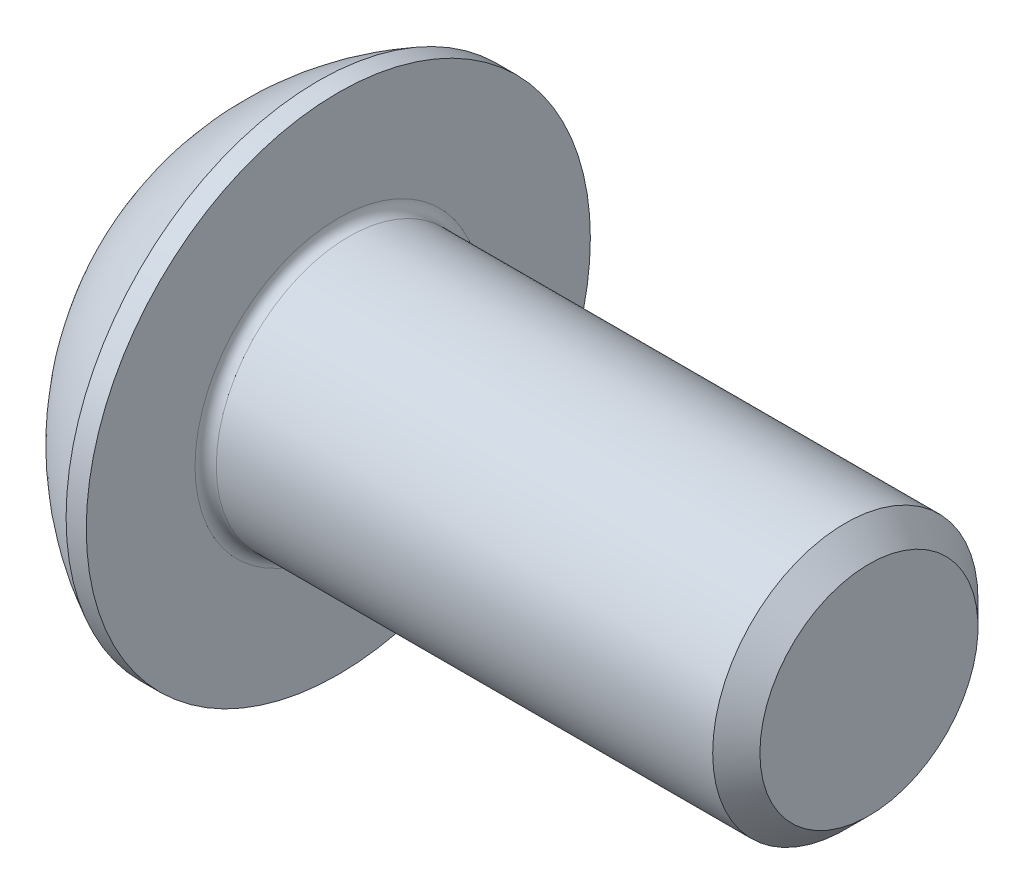
ISO-10303-21;
HEADER;
FILE_DESCRIPTION(('STEP AP214'),'2;1');
FILE_NAME('part.step','',(''),(''),'','','');
FILE_SCHEMA(('AUTOMOTIVE_DESIGN { 1 0 10303 214 1 1 1 1 }'));
ENDSEC;
DATA;
#1=APPLICATION_CONTEXT('core data for automotive mechanical design processes');
#2=APPLICATION_PROTOCOL_DEFINITION('international standard','automotive_design',2000,#1);
#3=PRODUCT_CONTEXT('',#1,'mechanical');
#4=PRODUCT('Part','Part','',(#3));
#5=PRODUCT_RELATED_PRODUCT_CATEGORY('part','',(#4));
#6=PRODUCT_DEFINITION_FORMATION('','',#4);
#7=PRODUCT_DEFINITION_CONTEXT('part definition',#1,'design');
#8=PRODUCT_DEFINITION('design','',#6,#7);
#9=PRODUCT_DEFINITION_SHAPE('','',#8);
#10=(LENGTH_UNIT() NAMED_UNIT(*) SI_UNIT(.MILLI.,.METRE.));
#11=(NAMED_UNIT(*) PLANE_ANGLE_UNIT() SI_UNIT($,.RADIAN.));
#12=(NAMED_UNIT(*) SI_UNIT($,.STERADIAN.) SOLID_ANGLE_UNIT());
#13=UNCERTAINTY_MEASURE_WITH_UNIT(LENGTH_MEASURE(1.E-05),#10,'distance_accuracy_value','');
#14=(GEOMETRIC_REPRESENTATION_CONTEXT(3) GLOBAL_UNCERTAINTY_ASSIGNED_CONTEXT((#13)) GLOBAL_UNIT_ASSIGNED_CONTEXT((#10,
#11,#12)) REPRESENTATION_CONTEXT('',''));
#15=CARTESIAN_POINT('',(0.,0.,0.));
#16=DIRECTION('',(0.,0.,1.));
#17=DIRECTION('',(1.,0.,0.));
#18=AXIS2_PLACEMENT_3D('',#15,#16,#17);
#19=CARTESIAN_POINT('',(0.,0.,0.));
#20=DIRECTION('',(-1.,0.,0.));
#21=DIRECTION('',(0.,0.,1.));
#22=AXIS2_PLACEMENT_3D('',#19,#20,#21);
#23=PLANE('',#22);
#24=CARTESIAN_POINT('',(0.,0.,0.));
#25=DIRECTION('',(-1.,0.,0.));
#26=DIRECTION('',(0.,0.,1.));
#27=AXIS2_PLACEMENT_3D('',#24,#25,#26);
#28=CIRCLE('',#27,2.375);
#29=CARTESIAN_POINT('',(0.,0.,2.375));
#30=VERTEX_POINT('',#29);
#31=EDGE_CURVE('E154',#30,#30,#28,.T.);
#32=ORIENTED_EDGE('',*,*,#31,.T.);
#33=EDGE_LOOP('',(#32));
#34=FACE_BOUND('',#33,.T.);
#35=DIRECTION('',(0.,-1.,0.));
#36=VECTOR('',#35,1.);
#37=CARTESIAN_POINT('',(0.,-0.866025403784438,1.5));
#38=LINE('',#37,#36);
#39=CARTESIAN_POINT('',(0.,0.866025403784439,1.5));
#40=VERTEX_POINT('',#39);
#41=CARTESIAN_POINT('',(0.,-0.866025403784438,1.5));
#42=VERTEX_POINT('',#41);
#43=EDGE_CURVE('E49',#40,#42,#38,.T.);
#44=ORIENTED_EDGE('',*,*,#43,.T.);
#45=DIRECTION('',(0.,-0.500000000000001,-0.866025403784438));
#46=VECTOR('',#45,1.);
#47=CARTESIAN_POINT('',(0.,-1.73205080756888,0.));
#48=LINE('',#47,#46);
#49=CARTESIAN_POINT('',(0.,-1.73205080756888,0.));
#50=VERTEX_POINT('',#49);
#51=EDGE_CURVE('E274',#42,#50,#48,.T.);
#52=ORIENTED_EDGE('',*,*,#51,.T.);
#53=DIRECTION('',(0.,0.500000000000001,-0.866025403784438));
#54=VECTOR('',#53,1.);
#55=CARTESIAN_POINT('',(0.,-0.866025403784438,-1.5));
#56=LINE('',#55,#54);
#57=CARTESIAN_POINT('',(0.,-0.866025403784438,-1.5));
#58=VERTEX_POINT('',#57);
#59=EDGE_CURVE('E129',#50,#58,#56,.T.);
#60=ORIENTED_EDGE('',*,*,#59,.T.);
#61=DIRECTION('',(0.,1.,0.));
#62=VECTOR('',#61,1.);
#63=CARTESIAN_POINT('',(0.,0.866025403784439,-1.5));
#64=LINE('',#63,#62);
#65=CARTESIAN_POINT('',(0.,0.866025403784439,-1.5));
#66=VERTEX_POINT('',#65);
#67=EDGE_CURVE('E277',#58,#66,#64,.T.);
#68=ORIENTED_EDGE('',*,*,#67,.T.);
#69=DIRECTION('',(0.,0.5,0.866025403784439));
#70=VECTOR('',#69,1.);
#71=CARTESIAN_POINT('',(0.,1.73205080756888,0.));
#72=LINE('',#71,#70);
#73=CARTESIAN_POINT('',(0.,1.73205080756888,0.));
#74=VERTEX_POINT('',#73);
#75=EDGE_CURVE('E279',#66,#74,#72,.T.);
#76=ORIENTED_EDGE('',*,*,#75,.T.);
#77=DIRECTION('',(0.,-0.5,0.866025403784439));
#78=VECTOR('',#77,1.);
#79=CARTESIAN_POINT('',(0.,0.866025403784439,1.5));
#80=LINE('',#79,#78);
#81=EDGE_CURVE('E281',#74,#40,#80,.T.);
#82=ORIENTED_EDGE('',*,*,#81,.T.);
#83=EDGE_LOOP('',(#44,#52,#60,#68,#76,#82));
#84=FACE_BOUND('',#83,.T.);
#85=ADVANCED_FACE('F34',(#34,#84),#23,.T.);
#86=CARTESIAN_POINT('',(4.75501582278481,0.,0.));
#87=DIRECTION('',(-1.,0.,0.));
#88=DIRECTION('',(0.,1.,0.));
#89=AXIS2_PLACEMENT_3D('',#86,#87,#88);
#90=SPHERICAL_SURFACE('',#89,5.3151482081814);
#91=CARTESIAN_POINT('',(2.37,0.,0.));
#92=DIRECTION('',(-1.,0.,0.));
#93=DIRECTION('',(0.,0.,1.));
#94=AXIS2_PLACEMENT_3D('',#91,#92,#93);
#95=CIRCLE('',#94,4.75);
#96=CARTESIAN_POINT('',(2.37,0.,4.75));
#97=VERTEX_POINT('',#96);
#98=EDGE_CURVE('E151',#97,#97,#95,.T.);
#99=ORIENTED_EDGE('',*,*,#98,.T.);
#100=EDGE_LOOP('',(#99));
#101=FACE_BOUND('',#100,.T.);
#102=ORIENTED_EDGE('',*,*,#31,.F.);
#103=EDGE_LOOP('',(#102));
#104=FACE_BOUND('',#103,.T.);
#105=ADVANCED_FACE('F175',(#101,#104),#90,.T.);
#106=CARTESIAN_POINT('',(0.,0.,0.));
#107=DIRECTION('',(-1.,0.,0.));
#108=DIRECTION('',(0.,0.,1.));
#109=AXIS2_PLACEMENT_3D('',#106,#107,#108);
#110=CYLINDRICAL_SURFACE('',#109,4.75);
#111=ORIENTED_EDGE('',*,*,#98,.F.);
#112=EDGE_LOOP('',(#111));
#113=FACE_BOUND('',#112,.T.);
#114=CARTESIAN_POINT('',(2.75,0.,0.));
#115=DIRECTION('',(-1.,0.,0.));
#116=DIRECTION('',(0.,0.,1.));
#117=AXIS2_PLACEMENT_3D('',#114,#115,#116);
#118=CIRCLE('',#117,4.75);
#119=CARTESIAN_POINT('',(2.75,0.,4.75));
#120=VERTEX_POINT('',#119);
#121=EDGE_CURVE('E148',#120,#120,#118,.T.);
#122=ORIENTED_EDGE('',*,*,#121,.T.);
#123=EDGE_LOOP('',(#122));
#124=FACE_BOUND('',#123,.T.);
#125=ADVANCED_FACE('F180',(#113,#124),#110,.T.);
#126=CARTESIAN_POINT('',(2.75,2.5,0.));
#127=DIRECTION('',(-1.,0.,0.));
#128=DIRECTION('',(0.,0.,1.));
#129=AXIS2_PLACEMENT_3D('',#126,#127,#128);
#130=PLANE('',#129);
#131=CARTESIAN_POINT('',(2.75,0.,0.));
#132=DIRECTION('',(-1.,0.,0.));
#133=DIRECTION('',(0.,0.,1.));
#134=AXIS2_PLACEMENT_3D('',#131,#132,#133);
#135=CIRCLE('',#134,2.7);
#136=CARTESIAN_POINT('',(2.75,0.,2.7));
#137=VERTEX_POINT('',#136);
#138=EDGE_CURVE('E42',#137,#137,#135,.T.);
#139=ORIENTED_EDGE('',*,*,#138,.T.);
#140=EDGE_LOOP('',(#139));
#141=FACE_BOUND('',#140,.T.);
#142=ORIENTED_EDGE('',*,*,#121,.F.);
#143=EDGE_LOOP('',(#142));
#144=FACE_BOUND('',#143,.T.);
#145=ADVANCED_FACE('F159',(#141,#144),#130,.F.);
#146=CARTESIAN_POINT('',(0.,0.,0.));
#147=DIRECTION('',(-1.,0.,0.));
#148=DIRECTION('',(0.,0.,1.));
#149=AXIS2_PLACEMENT_3D('',#146,#147,#148);
#150=CYLINDRICAL_SURFACE('',#149,2.5);
#151=CARTESIAN_POINT('',(2.95,0.,0.));
#152=DIRECTION('',(-1.,0.,0.));
#153=DIRECTION('',(0.,0.,1.));
#154=AXIS2_PLACEMENT_3D('',#151,#152,#153);
#155=CIRCLE('',#154,2.5);
#156=CARTESIAN_POINT('',(2.95,0.,2.5));
#157=VERTEX_POINT('',#156);
#158=EDGE_CURVE('E11',#157,#157,#155,.F.);
#159=ORIENTED_EDGE('',*,*,#158,.T.);
#160=EDGE_LOOP('',(#159));
#161=FACE_BOUND('',#160,.T.);
#162=CARTESIAN_POINT('',(12.305,0.,0.));
#163=DIRECTION('',(-1.,0.,0.));
#164=DIRECTION('',(0.,0.,1.));
#165=AXIS2_PLACEMENT_3D('',#162,#163,#164);
#166=CIRCLE('',#165,2.5);
#167=CARTESIAN_POINT('',(12.305,0.,2.5));
#168=VERTEX_POINT('',#167);
#169=EDGE_CURVE('E145',#168,#168,#166,.T.);
#170=ORIENTED_EDGE('',*,*,#169,.T.);
#171=EDGE_LOOP('',(#170));
#172=FACE_BOUND('',#171,.T.);
#173=ADVANCED_FACE('F189',(#161,#172),#150,.T.);
#174=CARTESIAN_POINT('',(12.75,0.,0.));
#175=DIRECTION('',(-1.,0.,0.));
#176=DIRECTION('',(0.,0.,1.));
#177=AXIS2_PLACEMENT_3D('',#174,#175,#176);
#178=CONICAL_SURFACE('',#177,2.055,0.78539816339744);
#179=ORIENTED_EDGE('',*,*,#169,.F.);
#180=EDGE_LOOP('',(#179));
#181=FACE_BOUND('',#180,.T.);
#182=CARTESIAN_POINT('',(12.75,0.,0.));
#183=DIRECTION('',(-1.,0.,0.));
#184=DIRECTION('',(0.,0.,1.));
#185=AXIS2_PLACEMENT_3D('',#182,#183,#184);
#186=CIRCLE('',#185,2.055);
#187=CARTESIAN_POINT('',(12.75,0.,2.055));
#188=VERTEX_POINT('',#187);
#189=EDGE_CURVE('E141',#188,#188,#186,.T.);
#190=ORIENTED_EDGE('',*,*,#189,.T.);
#191=EDGE_LOOP('',(#190));
#192=FACE_BOUND('',#191,.T.);
#193=ADVANCED_FACE('F170',(#181,#192),#178,.T.);
#194=CARTESIAN_POINT('',(12.75,0.,0.));
#195=DIRECTION('',(-1.,0.,0.));
#196=DIRECTION('',(0.,0.,1.));
#197=AXIS2_PLACEMENT_3D('',#194,#195,#196);
#198=PLANE('',#197);
#199=ORIENTED_EDGE('',*,*,#189,.F.);
#200=EDGE_LOOP('',(#199));
#201=FACE_BOUND('',#200,.T.);
#202=ADVANCED_FACE('F163',(#201),#198,.F.);
#203=CARTESIAN_POINT('',(2.95,0.,0.));
#204=DIRECTION('',(-1.,0.,0.));
#205=DIRECTION('',(0.,0.,1.));
#206=AXIS2_PLACEMENT_3D('',#203,#204,#205);
#207=TOROIDAL_SURFACE('',#206,2.7,0.2);
#208=ORIENTED_EDGE('',*,*,#158,.F.);
#209=EDGE_LOOP('',(#208));
#210=FACE_BOUND('',#209,.T.);
#211=ORIENTED_EDGE('',*,*,#138,.F.);
#212=EDGE_LOOP('',(#211));
#213=FACE_BOUND('',#212,.T.);
#214=ADVANCED_FACE('F36',(#210,#213),#207,.F.);
#215=CARTESIAN_POINT('',(1.56,-1.73205080756888,0.));
#216=DIRECTION('',(0.,0.866025403784438,-0.500000000000001));
#217=DIRECTION('',(0.,0.500000000000001,0.866025403784438));
#218=AXIS2_PLACEMENT_3D('',#215,#216,#217);
#219=PLANE('',#218);
#220=DIRECTION('',(0.,-0.500000000000001,-0.866025403784438));
#221=VECTOR('',#220,1.);
#222=CARTESIAN_POINT('',(1.56,-1.73205080756888,0.));
#223=LINE('',#222,#221);
#224=CARTESIAN_POINT('',(1.56,-0.866025403784438,1.5));
#225=VERTEX_POINT('',#224);
#226=CARTESIAN_POINT('',(1.56,-1.29903810567666,0.750000000000002));
#227=VERTEX_POINT('',#226);
#228=EDGE_CURVE('E115',#225,#227,#223,.T.);
#229=ORIENTED_EDGE('',*,*,#228,.T.);
#230=CARTESIAN_POINT('',(1.56,-1.73205080756888,0.));
#231=VERTEX_POINT('',#230);
#232=EDGE_CURVE('E110',#227,#231,#223,.T.);
#233=ORIENTED_EDGE('',*,*,#232,.T.);
#234=DIRECTION('',(-1.,0.,0.));
#235=VECTOR('',#234,1.);
#236=CARTESIAN_POINT('',(1.56,-1.73205080756888,0.));
#237=LINE('',#236,#235);
#238=EDGE_CURVE('E112',#231,#50,#237,.T.);
#239=ORIENTED_EDGE('',*,*,#238,.T.);
#240=ORIENTED_EDGE('',*,*,#51,.F.);
#241=DIRECTION('',(-1.,0.,0.));
#242=VECTOR('',#241,1.);
#243=CARTESIAN_POINT('',(1.56,-0.866025403784438,1.5));
#244=LINE('',#243,#242);
#245=EDGE_CURVE('E270',#225,#42,#244,.T.);
#246=ORIENTED_EDGE('',*,*,#245,.F.);
#247=EDGE_LOOP('',(#229,#233,#239,#240,#246));
#248=FACE_BOUND('',#247,.T.);
#249=ADVANCED_FACE('F111',(#248),#219,.T.);
#250=CARTESIAN_POINT('',(1.56,-0.866025403784438,-1.5));
#251=DIRECTION('',(0.,0.866025403784438,0.500000000000001));
#252=DIRECTION('',(0.,-0.500000000000001,0.866025403784438));
#253=AXIS2_PLACEMENT_3D('',#250,#251,#252);
#254=PLANE('',#253);
#255=DIRECTION('',(0.,0.500000000000001,-0.866025403784438));
#256=VECTOR('',#255,1.);
#257=CARTESIAN_POINT('',(1.56,-0.866025403784438,-1.5));
#258=LINE('',#257,#256);
#259=CARTESIAN_POINT('',(1.56,-1.29903810567666,-0.750000000000001));
#260=VERTEX_POINT('',#259);
#261=EDGE_CURVE('E57',#231,#260,#258,.T.);
#262=ORIENTED_EDGE('',*,*,#261,.T.);
#263=CARTESIAN_POINT('',(1.56,-0.866025403784438,-1.5));
#264=VERTEX_POINT('',#263);
#265=EDGE_CURVE('E124',#260,#264,#258,.T.);
#266=ORIENTED_EDGE('',*,*,#265,.T.);
#267=DIRECTION('',(-1.,0.,0.));
#268=VECTOR('',#267,1.);
#269=CARTESIAN_POINT('',(1.56,-0.866025403784438,-1.5));
#270=LINE('',#269,#268);
#271=EDGE_CURVE('E131',#264,#58,#270,.T.);
#272=ORIENTED_EDGE('',*,*,#271,.T.);
#273=ORIENTED_EDGE('',*,*,#59,.F.);
#274=ORIENTED_EDGE('',*,*,#238,.F.);
#275=EDGE_LOOP('',(#262,#266,#272,#273,#274));
#276=FACE_BOUND('',#275,.T.);
#277=ADVANCED_FACE('F127',(#276),#254,.T.);
#278=CARTESIAN_POINT('',(1.56,0.866025403784439,-1.5));
#279=DIRECTION('',(0.,0.,1.));
#280=DIRECTION('',(1.,0.,0.));
#281=AXIS2_PLACEMENT_3D('',#278,#279,#280);
#282=PLANE('',#281);
#283=DIRECTION('',(0.,1.,0.));
#284=VECTOR('',#283,1.);
#285=CARTESIAN_POINT('',(1.56,0.866025403784439,-1.5));
#286=LINE('',#285,#284);
#287=CARTESIAN_POINT('',(1.56,0.,-1.5));
#288=VERTEX_POINT('',#287);
#289=EDGE_CURVE('E251',#264,#288,#286,.T.);
#290=ORIENTED_EDGE('',*,*,#289,.T.);
#291=CARTESIAN_POINT('',(1.56,0.866025403784439,-1.5));
#292=VERTEX_POINT('',#291);
#293=EDGE_CURVE('E123',#288,#292,#286,.T.);
#294=ORIENTED_EDGE('',*,*,#293,.T.);
#295=DIRECTION('',(-1.,0.,0.));
#296=VECTOR('',#295,1.);
#297=CARTESIAN_POINT('',(1.56,0.866025403784439,-1.5));
#298=LINE('',#297,#296);
#299=EDGE_CURVE('E136',#292,#66,#298,.T.);
#300=ORIENTED_EDGE('',*,*,#299,.T.);
#301=ORIENTED_EDGE('',*,*,#67,.F.);
#302=ORIENTED_EDGE('',*,*,#271,.F.);
#303=EDGE_LOOP('',(#290,#294,#300,#301,#302));
#304=FACE_BOUND('',#303,.T.);
#305=ADVANCED_FACE('F203',(#304),#282,.T.);
#306=CARTESIAN_POINT('',(1.56,1.73205080756888,0.));
#307=DIRECTION('',(0.,-0.866025403784439,0.5));
#308=DIRECTION('',(0.,-0.5,-0.866025403784439));
#309=AXIS2_PLACEMENT_3D('',#306,#307,#308);
#310=PLANE('',#309);
#311=DIRECTION('',(0.,0.5,0.866025403784439));
#312=VECTOR('',#311,1.);
#313=CARTESIAN_POINT('',(1.56,1.73205080756888,0.));
#314=LINE('',#313,#312);
#315=CARTESIAN_POINT('',(1.56,1.29903810567666,-0.75));
#316=VERTEX_POINT('',#315);
#317=EDGE_CURVE('E240',#292,#316,#314,.T.);
#318=ORIENTED_EDGE('',*,*,#317,.T.);
#319=CARTESIAN_POINT('',(1.56,1.73205080756888,0.));
#320=VERTEX_POINT('',#319);
#321=EDGE_CURVE('E245',#316,#320,#314,.T.);
#322=ORIENTED_EDGE('',*,*,#321,.T.);
#323=DIRECTION('',(-1.,0.,0.));
#324=VECTOR('',#323,1.);
#325=CARTESIAN_POINT('',(1.56,1.73205080756888,0.));
#326=LINE('',#325,#324);
#327=EDGE_CURVE('E285',#320,#74,#326,.T.);
#328=ORIENTED_EDGE('',*,*,#327,.T.);
#329=ORIENTED_EDGE('',*,*,#75,.F.);
#330=ORIENTED_EDGE('',*,*,#299,.F.);
#331=EDGE_LOOP('',(#318,#322,#328,#329,#330));
#332=FACE_BOUND('',#331,.T.);
#333=ADVANCED_FACE('F206',(#332),#310,.T.);
#334=CARTESIAN_POINT('',(1.56,0.866025403784439,1.5));
#335=DIRECTION('',(0.,-0.866025403784439,-0.5));
#336=DIRECTION('',(0.,0.5,-0.866025403784439));
#337=AXIS2_PLACEMENT_3D('',#334,#335,#336);
#338=PLANE('',#337);
#339=DIRECTION('',(0.,-0.5,0.866025403784439));
#340=VECTOR('',#339,1.);
#341=CARTESIAN_POINT('',(1.56,0.866025403784439,1.5));
#342=LINE('',#341,#340);
#343=CARTESIAN_POINT('',(1.56,1.29903810567666,0.75));
#344=VERTEX_POINT('',#343);
#345=EDGE_CURVE('E248',#320,#344,#342,.T.);
#346=ORIENTED_EDGE('',*,*,#345,.T.);
#347=CARTESIAN_POINT('',(1.56,0.866025403784439,1.5));
#348=VERTEX_POINT('',#347);
#349=EDGE_CURVE('E256',#344,#348,#342,.T.);
#350=ORIENTED_EDGE('',*,*,#349,.T.);
#351=DIRECTION('',(-1.,0.,0.));
#352=VECTOR('',#351,1.);
#353=CARTESIAN_POINT('',(1.56,0.866025403784439,1.5));
#354=LINE('',#353,#352);
#355=EDGE_CURVE('E269',#348,#40,#354,.T.);
#356=ORIENTED_EDGE('',*,*,#355,.T.);
#357=ORIENTED_EDGE('',*,*,#81,.F.);
#358=ORIENTED_EDGE('',*,*,#327,.F.);
#359=EDGE_LOOP('',(#346,#350,#356,#357,#358));
#360=FACE_BOUND('',#359,.T.);
#361=ADVANCED_FACE('F210',(#360),#338,.T.);
#362=CARTESIAN_POINT('',(1.56,-0.866025403784438,1.5));
#363=DIRECTION('',(0.,0.,-1.));
#364=DIRECTION('',(-1.,0.,0.));
#365=AXIS2_PLACEMENT_3D('',#362,#363,#364);
#366=PLANE('',#365);
#367=DIRECTION('',(0.,-1.,0.));
#368=VECTOR('',#367,1.);
#369=CARTESIAN_POINT('',(1.56,-0.866025403784438,1.5));
#370=LINE('',#369,#368);
#371=CARTESIAN_POINT('',(1.56,0.,1.5));
#372=VERTEX_POINT('',#371);
#373=EDGE_CURVE('E262',#348,#372,#370,.T.);
#374=ORIENTED_EDGE('',*,*,#373,.T.);
#375=EDGE_CURVE('E264',#372,#225,#370,.T.);
#376=ORIENTED_EDGE('',*,*,#375,.T.);
#377=ORIENTED_EDGE('',*,*,#245,.T.);
#378=ORIENTED_EDGE('',*,*,#43,.F.);
#379=ORIENTED_EDGE('',*,*,#355,.F.);
#380=EDGE_LOOP('',(#374,#376,#377,#378,#379));
#381=FACE_BOUND('',#380,.T.);
#382=ADVANCED_FACE('F214',(#381),#366,.T.);
#383=CARTESIAN_POINT('',(1.56,-1.73205080756888,0.));
#384=DIRECTION('',(1.,0.,0.));
#385=DIRECTION('',(0.,0.,-1.));
#386=AXIS2_PLACEMENT_3D('',#383,#384,#385);
#387=PLANE('',#386);
#388=CARTESIAN_POINT('',(1.56,0.,0.));
#389=DIRECTION('',(-1.,0.,0.));
#390=DIRECTION('',(0.,0.,1.));
#391=AXIS2_PLACEMENT_3D('',#388,#389,#390);
#392=CIRCLE('',#391,1.5);
#393=EDGE_CURVE('E237',#316,#288,#392,.T.);
#394=ORIENTED_EDGE('',*,*,#393,.F.);
#395=ORIENTED_EDGE('',*,*,#317,.F.);
#396=ORIENTED_EDGE('',*,*,#293,.F.);
#397=EDGE_LOOP('',(#394,#395,#396));
#398=FACE_BOUND('',#397,.T.);
#399=ADVANCED_FACE('F218',(#398),#387,.F.);
#400=EDGE_CURVE('E142',#344,#316,#392,.T.);
#401=ORIENTED_EDGE('',*,*,#400,.F.);
#402=ORIENTED_EDGE('',*,*,#345,.F.);
#403=ORIENTED_EDGE('',*,*,#321,.F.);
#404=EDGE_LOOP('',(#401,#402,#403));
#405=FACE_BOUND('',#404,.T.);
#406=ADVANCED_FACE('F227',(#405),#387,.F.);
#407=EDGE_CURVE('E135',#372,#344,#392,.T.);
#408=ORIENTED_EDGE('',*,*,#407,.F.);
#409=ORIENTED_EDGE('',*,*,#373,.F.);
#410=ORIENTED_EDGE('',*,*,#349,.F.);
#411=EDGE_LOOP('',(#408,#409,#410));
#412=FACE_BOUND('',#411,.T.);
#413=ADVANCED_FACE('F232',(#412),#387,.F.);
#414=EDGE_CURVE('E130',#227,#372,#392,.T.);
#415=ORIENTED_EDGE('',*,*,#414,.F.);
#416=ORIENTED_EDGE('',*,*,#228,.F.);
#417=ORIENTED_EDGE('',*,*,#375,.F.);
#418=EDGE_LOOP('',(#415,#416,#417));
#419=FACE_BOUND('',#418,.T.);
#420=ADVANCED_FACE('F225',(#419),#387,.F.);
#421=EDGE_CURVE('E121',#260,#227,#392,.T.);
#422=ORIENTED_EDGE('',*,*,#421,.F.);
#423=ORIENTED_EDGE('',*,*,#261,.F.);
#424=ORIENTED_EDGE('',*,*,#232,.F.);
#425=EDGE_LOOP('',(#422,#423,#424));
#426=FACE_BOUND('',#425,.T.);
#427=ADVANCED_FACE('F120',(#426),#387,.F.);
#428=EDGE_CURVE('E243',#288,#260,#392,.T.);
#429=ORIENTED_EDGE('',*,*,#428,.F.);
#430=ORIENTED_EDGE('',*,*,#289,.F.);
#431=ORIENTED_EDGE('',*,*,#265,.F.);
#432=EDGE_LOOP('',(#429,#430,#431));
#433=FACE_BOUND('',#432,.T.);
#434=ADVANCED_FACE('F198',(#433),#387,.F.);
#435=CARTESIAN_POINT('',(2.42602540378445,0.,0.));
#436=DIRECTION('',(-1.,0.,0.));
#437=DIRECTION('',(0.,0.,1.));
#438=AXIS2_PLACEMENT_3D('',#435,#436,#437);
#439=CONICAL_SURFACE('',#438,0.,1.04719755119659);
#440=ORIENTED_EDGE('',*,*,#407,.T.);
#441=ORIENTED_EDGE('',*,*,#400,.T.);
#442=ORIENTED_EDGE('',*,*,#393,.T.);
#443=ORIENTED_EDGE('',*,*,#428,.T.);
#444=ORIENTED_EDGE('',*,*,#421,.T.);
#445=ORIENTED_EDGE('',*,*,#414,.T.);
#446=EDGE_LOOP('',(#440,#441,#442,#443,#444,#445));
#447=FACE_BOUND('',#446,.T.);
#448=CARTESIAN_POINT('',(2.42602540378445,0.,0.));
#449=VERTEX_POINT('',#448);
#450=VERTEX_LOOP('',#449);
#451=FACE_BOUND('',#450,.T.);
#452=ADVANCED_FACE('F196',(#447,#451),#439,.F.);
#453=CLOSED_SHELL('',(#85,#105,#125,#145,#173,#193,#202,#214,#249,#277,#305,#333,#361,#382,#399,
#406,#413,#420,#427,#434,#452));
#454=MANIFOLD_SOLID_BREP('B2',#453);
#455=ADVANCED_BREP_SHAPE_REPRESENTATION('',(#18,#454),#14);
#456=SHAPE_DEFINITION_REPRESENTATION(#9,#455);
ENDSEC;
END-ISO-10303-21;
